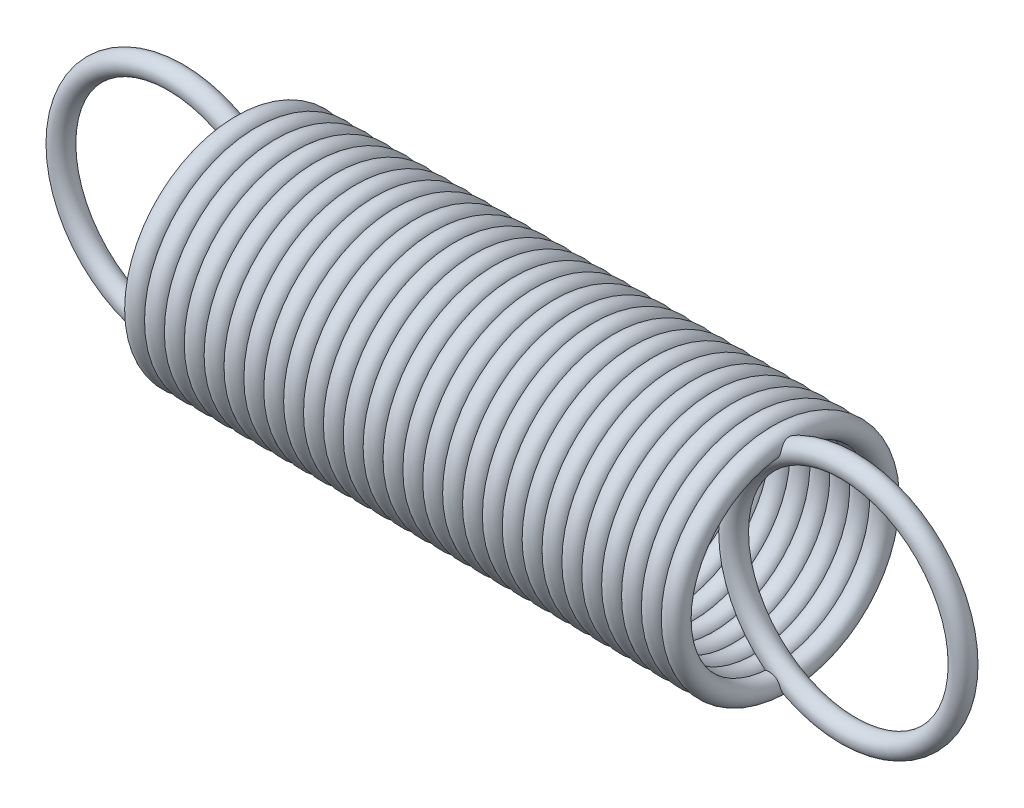
ISO-10303-21;
HEADER;
FILE_DESCRIPTION(('STEP AP214'),'2;1');
FILE_NAME('part.step','',(''),(''),'','','');
FILE_SCHEMA(('AUTOMOTIVE_DESIGN { 1 0 10303 214 1 1 1 1 }'));
ENDSEC;
DATA;
#1=APPLICATION_CONTEXT('core data for automotive mechanical design processes');
#2=APPLICATION_PROTOCOL_DEFINITION('international standard','automotive_design',2000,#1);
#3=PRODUCT_CONTEXT('',#1,'mechanical');
#4=PRODUCT('Part','Part','',(#3));
#5=PRODUCT_RELATED_PRODUCT_CATEGORY('part','',(#4));
#6=PRODUCT_DEFINITION_FORMATION('','',#4);
#7=PRODUCT_DEFINITION_CONTEXT('part definition',#1,'design');
#8=PRODUCT_DEFINITION('design','',#6,#7);
#9=PRODUCT_DEFINITION_SHAPE('','',#8);
#10=(LENGTH_UNIT() NAMED_UNIT(*) SI_UNIT(.MILLI.,.METRE.));
#11=(NAMED_UNIT(*) PLANE_ANGLE_UNIT() SI_UNIT($,.RADIAN.));
#12=(NAMED_UNIT(*) SI_UNIT($,.STERADIAN.) SOLID_ANGLE_UNIT());
#13=UNCERTAINTY_MEASURE_WITH_UNIT(LENGTH_MEASURE(1.E-05),#10,'distance_accuracy_value','');
#14=(GEOMETRIC_REPRESENTATION_CONTEXT(3) GLOBAL_UNCERTAINTY_ASSIGNED_CONTEXT((#13)) GLOBAL_UNIT_ASSIGNED_CONTEXT((#10,
#11,#12)) REPRESENTATION_CONTEXT('',''));
#15=CARTESIAN_POINT('',(0.,0.,0.));
#16=DIRECTION('',(0.,0.,1.));
#17=DIRECTION('',(1.,0.,0.));
#18=AXIS2_PLACEMENT_3D('',#15,#16,#17);
#19=CARTESIAN_POINT('',(16.7318268848316,0.,0.));
#20=DIRECTION('',(0.,0.,1.));
#21=DIRECTION('',(1.,0.,0.));
#22=AXIS2_PLACEMENT_3D('',#19,#20,#21);
#23=TOROIDAL_SURFACE('',#22,3.175,0.292099999999998);
#24=CARTESIAN_POINT('',(20.1989268848316,0.,0.));
#25=VERTEX_POINT('',#24);
#26=VERTEX_LOOP('',#25);
#27=FACE_BOUND('',#26,.T.);
#28=ADVANCED_FACE('F36',(#27),#23,.T.);
#29=CLOSED_SHELL('',(#28));
#30=MANIFOLD_SOLID_BREP('B2',#29);
#31=CARTESIAN_POINT('',(-1.88381324950144,0.,0.));
#32=DIRECTION('',(0.,0.,1.));
#33=DIRECTION('',(1.,0.,0.));
#34=AXIS2_PLACEMENT_3D('',#31,#32,#33);
#35=TOROIDAL_SURFACE('',#34,3.175,0.2921);
#36=CARTESIAN_POINT('',(1.58328675049856,0.,0.));
#37=VERTEX_POINT('',#36);
#38=VERTEX_LOOP('',#37);
#39=FACE_BOUND('',#38,.T.);
#40=ADVANCED_FACE('F55',(#39),#35,.T.);
#41=CLOSED_SHELL('',(#40));
#42=MANIFOLD_SOLID_BREP('B6',#41);
#43=CARTESIAN_POINT('',(14.85,0.,0.));
#44=DIRECTION('',(-1.,0.,0.));
#45=DIRECTION('',(0.,0.,1.));
#46=AXIS2_PLACEMENT_3D('',#43,#44,#45);
#47=TOROIDAL_SURFACE('',#46,2.8829,0.2921);
#48=CARTESIAN_POINT('',(14.85,0.,3.175));
#49=VERTEX_POINT('',#48);
#50=VERTEX_LOOP('',#49);
#51=FACE_BOUND('',#50,.T.);
#52=ADVANCED_FACE('F74',(#51),#47,.T.);
#53=CLOSED_SHELL('',(#52));
#54=MANIFOLD_SOLID_BREP('B32',#53);
#55=CARTESIAN_POINT('',(14.3,0.,0.));
#56=DIRECTION('',(-1.,0.,0.));
#57=DIRECTION('',(0.,0.,1.));
#58=AXIS2_PLACEMENT_3D('',#55,#56,#57);
#59=TOROIDAL_SURFACE('',#58,2.8829,0.2921);
#60=CARTESIAN_POINT('',(14.3,0.,3.175));
#61=VERTEX_POINT('',#60);
#62=VERTEX_LOOP('',#61);
#63=FACE_BOUND('',#62,.T.);
#64=ADVANCED_FACE('F93',(#63),#59,.T.);
#65=CLOSED_SHELL('',(#64));
#66=MANIFOLD_SOLID_BREP('B51',#65);
#67=CARTESIAN_POINT('',(13.75,0.,0.));
#68=DIRECTION('',(-1.,0.,0.));
#69=DIRECTION('',(0.,0.,1.));
#70=AXIS2_PLACEMENT_3D('',#67,#68,#69);
#71=TOROIDAL_SURFACE('',#70,2.8829,0.2921);
#72=CARTESIAN_POINT('',(13.75,0.,3.175));
#73=VERTEX_POINT('',#72);
#74=VERTEX_LOOP('',#73);
#75=FACE_BOUND('',#74,.T.);
#76=ADVANCED_FACE('F112',(#75),#71,.T.);
#77=CLOSED_SHELL('',(#76));
#78=MANIFOLD_SOLID_BREP('B70',#77);
#79=CARTESIAN_POINT('',(13.2,0.,0.));
#80=DIRECTION('',(-1.,0.,0.));
#81=DIRECTION('',(0.,0.,1.));
#82=AXIS2_PLACEMENT_3D('',#79,#80,#81);
#83=TOROIDAL_SURFACE('',#82,2.8829,0.2921);
#84=CARTESIAN_POINT('',(13.2,0.,3.175));
#85=VERTEX_POINT('',#84);
#86=VERTEX_LOOP('',#85);
#87=FACE_BOUND('',#86,.T.);
#88=ADVANCED_FACE('F131',(#87),#83,.T.);
#89=CLOSED_SHELL('',(#88));
#90=MANIFOLD_SOLID_BREP('B89',#89);
#91=CARTESIAN_POINT('',(12.65,0.,0.));
#92=DIRECTION('',(-1.,0.,0.));
#93=DIRECTION('',(0.,0.,1.));
#94=AXIS2_PLACEMENT_3D('',#91,#92,#93);
#95=TOROIDAL_SURFACE('',#94,2.8829,0.2921);
#96=CARTESIAN_POINT('',(12.65,0.,3.175));
#97=VERTEX_POINT('',#96);
#98=VERTEX_LOOP('',#97);
#99=FACE_BOUND('',#98,.T.);
#100=ADVANCED_FACE('F150',(#99),#95,.T.);
#101=CLOSED_SHELL('',(#100));
#102=MANIFOLD_SOLID_BREP('B108',#101);
#103=CARTESIAN_POINT('',(12.1,0.,0.));
#104=DIRECTION('',(-1.,0.,0.));
#105=DIRECTION('',(0.,0.,1.));
#106=AXIS2_PLACEMENT_3D('',#103,#104,#105);
#107=TOROIDAL_SURFACE('',#106,2.8829,0.2921);
#108=CARTESIAN_POINT('',(12.1,0.,3.175));
#109=VERTEX_POINT('',#108);
#110=VERTEX_LOOP('',#109);
#111=FACE_BOUND('',#110,.T.);
#112=ADVANCED_FACE('F169',(#111),#107,.T.);
#113=CLOSED_SHELL('',(#112));
#114=MANIFOLD_SOLID_BREP('B127',#113);
#115=CARTESIAN_POINT('',(11.55,0.,0.));
#116=DIRECTION('',(-1.,0.,0.));
#117=DIRECTION('',(0.,0.,1.));
#118=AXIS2_PLACEMENT_3D('',#115,#116,#117);
#119=TOROIDAL_SURFACE('',#118,2.8829,0.2921);
#120=CARTESIAN_POINT('',(11.55,0.,3.175));
#121=VERTEX_POINT('',#120);
#122=VERTEX_LOOP('',#121);
#123=FACE_BOUND('',#122,.T.);
#124=ADVANCED_FACE('F188',(#123),#119,.T.);
#125=CLOSED_SHELL('',(#124));
#126=MANIFOLD_SOLID_BREP('B146',#125);
#127=CARTESIAN_POINT('',(11.,0.,0.));
#128=DIRECTION('',(-1.,0.,0.));
#129=DIRECTION('',(0.,0.,1.));
#130=AXIS2_PLACEMENT_3D('',#127,#128,#129);
#131=TOROIDAL_SURFACE('',#130,2.8829,0.2921);
#132=CARTESIAN_POINT('',(11.,0.,3.175));
#133=VERTEX_POINT('',#132);
#134=VERTEX_LOOP('',#133);
#135=FACE_BOUND('',#134,.T.);
#136=ADVANCED_FACE('F207',(#135),#131,.T.);
#137=CLOSED_SHELL('',(#136));
#138=MANIFOLD_SOLID_BREP('B165',#137);
#139=CARTESIAN_POINT('',(10.45,0.,0.));
#140=DIRECTION('',(-1.,0.,0.));
#141=DIRECTION('',(0.,0.,1.));
#142=AXIS2_PLACEMENT_3D('',#139,#140,#141);
#143=TOROIDAL_SURFACE('',#142,2.8829,0.2921);
#144=CARTESIAN_POINT('',(10.45,0.,3.175));
#145=VERTEX_POINT('',#144);
#146=VERTEX_LOOP('',#145);
#147=FACE_BOUND('',#146,.T.);
#148=ADVANCED_FACE('F226',(#147),#143,.T.);
#149=CLOSED_SHELL('',(#148));
#150=MANIFOLD_SOLID_BREP('B184',#149);
#151=CARTESIAN_POINT('',(9.9,0.,0.));
#152=DIRECTION('',(-1.,0.,0.));
#153=DIRECTION('',(0.,0.,1.));
#154=AXIS2_PLACEMENT_3D('',#151,#152,#153);
#155=TOROIDAL_SURFACE('',#154,2.8829,0.2921);
#156=CARTESIAN_POINT('',(9.9,0.,3.175));
#157=VERTEX_POINT('',#156);
#158=VERTEX_LOOP('',#157);
#159=FACE_BOUND('',#158,.T.);
#160=ADVANCED_FACE('F245',(#159),#155,.T.);
#161=CLOSED_SHELL('',(#160));
#162=MANIFOLD_SOLID_BREP('B203',#161);
#163=CARTESIAN_POINT('',(9.35,0.,0.));
#164=DIRECTION('',(-1.,0.,0.));
#165=DIRECTION('',(0.,0.,1.));
#166=AXIS2_PLACEMENT_3D('',#163,#164,#165);
#167=TOROIDAL_SURFACE('',#166,2.8829,0.2921);
#168=CARTESIAN_POINT('',(9.35,0.,3.175));
#169=VERTEX_POINT('',#168);
#170=VERTEX_LOOP('',#169);
#171=FACE_BOUND('',#170,.T.);
#172=ADVANCED_FACE('F264',(#171),#167,.T.);
#173=CLOSED_SHELL('',(#172));
#174=MANIFOLD_SOLID_BREP('B222',#173);
#175=CARTESIAN_POINT('',(8.8,0.,0.));
#176=DIRECTION('',(-1.,0.,0.));
#177=DIRECTION('',(0.,0.,1.));
#178=AXIS2_PLACEMENT_3D('',#175,#176,#177);
#179=TOROIDAL_SURFACE('',#178,2.8829,0.2921);
#180=CARTESIAN_POINT('',(8.8,0.,3.175));
#181=VERTEX_POINT('',#180);
#182=VERTEX_LOOP('',#181);
#183=FACE_BOUND('',#182,.T.);
#184=ADVANCED_FACE('F283',(#183),#179,.T.);
#185=CLOSED_SHELL('',(#184));
#186=MANIFOLD_SOLID_BREP('B241',#185);
#187=CARTESIAN_POINT('',(8.25,0.,0.));
#188=DIRECTION('',(-1.,0.,0.));
#189=DIRECTION('',(0.,0.,1.));
#190=AXIS2_PLACEMENT_3D('',#187,#188,#189);
#191=TOROIDAL_SURFACE('',#190,2.8829,0.2921);
#192=CARTESIAN_POINT('',(8.25,0.,3.175));
#193=VERTEX_POINT('',#192);
#194=VERTEX_LOOP('',#193);
#195=FACE_BOUND('',#194,.T.);
#196=ADVANCED_FACE('F302',(#195),#191,.T.);
#197=CLOSED_SHELL('',(#196));
#198=MANIFOLD_SOLID_BREP('B260',#197);
#199=CARTESIAN_POINT('',(7.7,0.,0.));
#200=DIRECTION('',(-1.,0.,0.));
#201=DIRECTION('',(0.,0.,1.));
#202=AXIS2_PLACEMENT_3D('',#199,#200,#201);
#203=TOROIDAL_SURFACE('',#202,2.8829,0.2921);
#204=CARTESIAN_POINT('',(7.7,0.,3.175));
#205=VERTEX_POINT('',#204);
#206=VERTEX_LOOP('',#205);
#207=FACE_BOUND('',#206,.T.);
#208=ADVANCED_FACE('F321',(#207),#203,.T.);
#209=CLOSED_SHELL('',(#208));
#210=MANIFOLD_SOLID_BREP('B279',#209);
#211=CARTESIAN_POINT('',(7.15,0.,0.));
#212=DIRECTION('',(-1.,0.,0.));
#213=DIRECTION('',(0.,0.,1.));
#214=AXIS2_PLACEMENT_3D('',#211,#212,#213);
#215=TOROIDAL_SURFACE('',#214,2.8829,0.2921);
#216=CARTESIAN_POINT('',(7.15,0.,3.175));
#217=VERTEX_POINT('',#216);
#218=VERTEX_LOOP('',#217);
#219=FACE_BOUND('',#218,.T.);
#220=ADVANCED_FACE('F340',(#219),#215,.T.);
#221=CLOSED_SHELL('',(#220));
#222=MANIFOLD_SOLID_BREP('B298',#221);
#223=CARTESIAN_POINT('',(6.6,0.,0.));
#224=DIRECTION('',(-1.,0.,0.));
#225=DIRECTION('',(0.,0.,1.));
#226=AXIS2_PLACEMENT_3D('',#223,#224,#225);
#227=TOROIDAL_SURFACE('',#226,2.8829,0.2921);
#228=CARTESIAN_POINT('',(6.6,0.,3.175));
#229=VERTEX_POINT('',#228);
#230=VERTEX_LOOP('',#229);
#231=FACE_BOUND('',#230,.T.);
#232=ADVANCED_FACE('F359',(#231),#227,.T.);
#233=CLOSED_SHELL('',(#232));
#234=MANIFOLD_SOLID_BREP('B317',#233);
#235=CARTESIAN_POINT('',(6.05,0.,0.));
#236=DIRECTION('',(-1.,0.,0.));
#237=DIRECTION('',(0.,0.,1.));
#238=AXIS2_PLACEMENT_3D('',#235,#236,#237);
#239=TOROIDAL_SURFACE('',#238,2.8829,0.2921);
#240=CARTESIAN_POINT('',(6.05,0.,3.175));
#241=VERTEX_POINT('',#240);
#242=VERTEX_LOOP('',#241);
#243=FACE_BOUND('',#242,.T.);
#244=ADVANCED_FACE('F378',(#243),#239,.T.);
#245=CLOSED_SHELL('',(#244));
#246=MANIFOLD_SOLID_BREP('B336',#245);
#247=CARTESIAN_POINT('',(5.5,0.,0.));
#248=DIRECTION('',(-1.,0.,0.));
#249=DIRECTION('',(0.,0.,1.));
#250=AXIS2_PLACEMENT_3D('',#247,#248,#249);
#251=TOROIDAL_SURFACE('',#250,2.8829,0.2921);
#252=CARTESIAN_POINT('',(5.5,0.,3.175));
#253=VERTEX_POINT('',#252);
#254=VERTEX_LOOP('',#253);
#255=FACE_BOUND('',#254,.T.);
#256=ADVANCED_FACE('F397',(#255),#251,.T.);
#257=CLOSED_SHELL('',(#256));
#258=MANIFOLD_SOLID_BREP('B355',#257);
#259=CARTESIAN_POINT('',(4.95,0.,0.));
#260=DIRECTION('',(-1.,0.,0.));
#261=DIRECTION('',(0.,0.,1.));
#262=AXIS2_PLACEMENT_3D('',#259,#260,#261);
#263=TOROIDAL_SURFACE('',#262,2.8829,0.2921);
#264=CARTESIAN_POINT('',(4.95,0.,3.175));
#265=VERTEX_POINT('',#264);
#266=VERTEX_LOOP('',#265);
#267=FACE_BOUND('',#266,.T.);
#268=ADVANCED_FACE('F416',(#267),#263,.T.);
#269=CLOSED_SHELL('',(#268));
#270=MANIFOLD_SOLID_BREP('B374',#269);
#271=CARTESIAN_POINT('',(4.4,0.,0.));
#272=DIRECTION('',(-1.,0.,0.));
#273=DIRECTION('',(0.,0.,1.));
#274=AXIS2_PLACEMENT_3D('',#271,#272,#273);
#275=TOROIDAL_SURFACE('',#274,2.8829,0.2921);
#276=CARTESIAN_POINT('',(4.4,0.,3.175));
#277=VERTEX_POINT('',#276);
#278=VERTEX_LOOP('',#277);
#279=FACE_BOUND('',#278,.T.);
#280=ADVANCED_FACE('F435',(#279),#275,.T.);
#281=CLOSED_SHELL('',(#280));
#282=MANIFOLD_SOLID_BREP('B393',#281);
#283=CARTESIAN_POINT('',(3.85,0.,0.));
#284=DIRECTION('',(-1.,0.,0.));
#285=DIRECTION('',(0.,0.,1.));
#286=AXIS2_PLACEMENT_3D('',#283,#284,#285);
#287=TOROIDAL_SURFACE('',#286,2.8829,0.2921);
#288=CARTESIAN_POINT('',(3.85,0.,3.175));
#289=VERTEX_POINT('',#288);
#290=VERTEX_LOOP('',#289);
#291=FACE_BOUND('',#290,.T.);
#292=ADVANCED_FACE('F454',(#291),#287,.T.);
#293=CLOSED_SHELL('',(#292));
#294=MANIFOLD_SOLID_BREP('B412',#293);
#295=CARTESIAN_POINT('',(3.3,0.,0.));
#296=DIRECTION('',(-1.,0.,0.));
#297=DIRECTION('',(0.,0.,1.));
#298=AXIS2_PLACEMENT_3D('',#295,#296,#297);
#299=TOROIDAL_SURFACE('',#298,2.8829,0.2921);
#300=CARTESIAN_POINT('',(3.3,0.,3.175));
#301=VERTEX_POINT('',#300);
#302=VERTEX_LOOP('',#301);
#303=FACE_BOUND('',#302,.T.);
#304=ADVANCED_FACE('F473',(#303),#299,.T.);
#305=CLOSED_SHELL('',(#304));
#306=MANIFOLD_SOLID_BREP('B431',#305);
#307=CARTESIAN_POINT('',(2.75,0.,0.));
#308=DIRECTION('',(-1.,0.,0.));
#309=DIRECTION('',(0.,0.,1.));
#310=AXIS2_PLACEMENT_3D('',#307,#308,#309);
#311=TOROIDAL_SURFACE('',#310,2.8829,0.2921);
#312=CARTESIAN_POINT('',(2.75,0.,3.175));
#313=VERTEX_POINT('',#312);
#314=VERTEX_LOOP('',#313);
#315=FACE_BOUND('',#314,.T.);
#316=ADVANCED_FACE('F492',(#315),#311,.T.);
#317=CLOSED_SHELL('',(#316));
#318=MANIFOLD_SOLID_BREP('B450',#317);
#319=CARTESIAN_POINT('',(2.2,0.,0.));
#320=DIRECTION('',(-1.,0.,0.));
#321=DIRECTION('',(0.,0.,1.));
#322=AXIS2_PLACEMENT_3D('',#319,#320,#321);
#323=TOROIDAL_SURFACE('',#322,2.8829,0.2921);
#324=CARTESIAN_POINT('',(2.2,0.,3.175));
#325=VERTEX_POINT('',#324);
#326=VERTEX_LOOP('',#325);
#327=FACE_BOUND('',#326,.T.);
#328=ADVANCED_FACE('F511',(#327),#323,.T.);
#329=CLOSED_SHELL('',(#328));
#330=MANIFOLD_SOLID_BREP('B469',#329);
#331=CARTESIAN_POINT('',(1.65,0.,0.));
#332=DIRECTION('',(-1.,0.,0.));
#333=DIRECTION('',(0.,0.,1.));
#334=AXIS2_PLACEMENT_3D('',#331,#332,#333);
#335=TOROIDAL_SURFACE('',#334,2.8829,0.2921);
#336=CARTESIAN_POINT('',(1.65,0.,3.175));
#337=VERTEX_POINT('',#336);
#338=VERTEX_LOOP('',#337);
#339=FACE_BOUND('',#338,.T.);
#340=ADVANCED_FACE('F530',(#339),#335,.T.);
#341=CLOSED_SHELL('',(#340));
#342=MANIFOLD_SOLID_BREP('B488',#341);
#343=CARTESIAN_POINT('',(1.1,0.,0.));
#344=DIRECTION('',(-1.,0.,0.));
#345=DIRECTION('',(0.,0.,1.));
#346=AXIS2_PLACEMENT_3D('',#343,#344,#345);
#347=TOROIDAL_SURFACE('',#346,2.8829,0.2921);
#348=CARTESIAN_POINT('',(1.1,0.,3.175));
#349=VERTEX_POINT('',#348);
#350=VERTEX_LOOP('',#349);
#351=FACE_BOUND('',#350,.T.);
#352=ADVANCED_FACE('F549',(#351),#347,.T.);
#353=CLOSED_SHELL('',(#352));
#354=MANIFOLD_SOLID_BREP('B507',#353);
#355=CARTESIAN_POINT('',(0.55,0.,0.));
#356=DIRECTION('',(-1.,0.,0.));
#357=DIRECTION('',(0.,0.,1.));
#358=AXIS2_PLACEMENT_3D('',#355,#356,#357);
#359=TOROIDAL_SURFACE('',#358,2.8829,0.2921);
#360=CARTESIAN_POINT('',(0.55,0.,3.175));
#361=VERTEX_POINT('',#360);
#362=VERTEX_LOOP('',#361);
#363=FACE_BOUND('',#362,.T.);
#364=ADVANCED_FACE('F567',(#363),#359,.T.);
#365=CLOSED_SHELL('',(#364));
#366=MANIFOLD_SOLID_BREP('B526',#365);
#367=CARTESIAN_POINT('',(0.,0.,0.));
#368=DIRECTION('',(-1.,0.,0.));
#369=DIRECTION('',(0.,0.,1.));
#370=AXIS2_PLACEMENT_3D('',#367,#368,#369);
#371=TOROIDAL_SURFACE('',#370,2.8829,0.2921);
#372=CARTESIAN_POINT('',(0.,0.,3.175));
#373=VERTEX_POINT('',#372);
#374=VERTEX_LOOP('',#373);
#375=FACE_BOUND('',#374,.T.);
#376=ADVANCED_FACE('F580',(#375),#371,.T.);
#377=CLOSED_SHELL('',(#376));
#378=MANIFOLD_SOLID_BREP('B545',#377);
#379=ADVANCED_BREP_SHAPE_REPRESENTATION('',(#18,#30,#42,#54,#66,#78,#90,#102,#114,#126,#138,
#150,#162,#174,#186,#198,#210,#222,#234,#246,#258,#270,#282,#294,#306,#318,#330,#342,#354,#366,
#378),#14);
#380=SHAPE_DEFINITION_REPRESENTATION(#9,#379);
ENDSEC;
END-ISO-10303-21;
